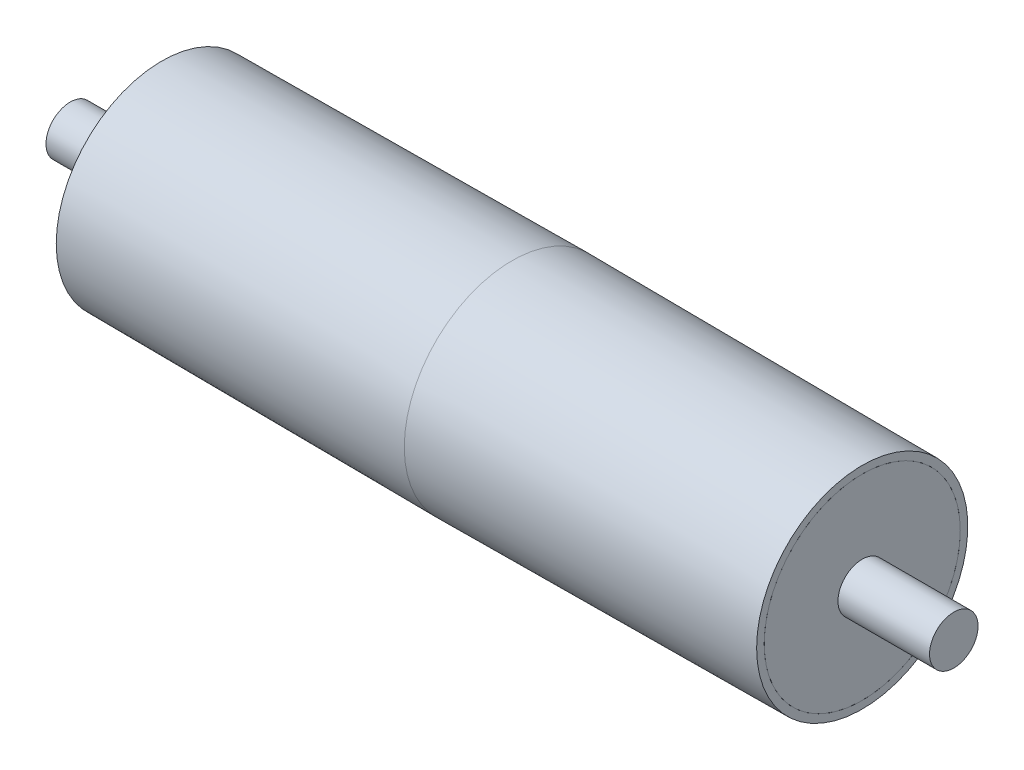
ISO-10303-21;
HEADER;
FILE_DESCRIPTION(('STEP AP214'),'2;1');
FILE_NAME('part.step','',(''),(''),'','','');
FILE_SCHEMA(('AUTOMOTIVE_DESIGN { 1 0 10303 214 1 1 1 1 }'));
ENDSEC;
DATA;
#1=APPLICATION_CONTEXT('core data for automotive mechanical design processes');
#2=APPLICATION_PROTOCOL_DEFINITION('international standard','automotive_design',2000,#1);
#3=PRODUCT_CONTEXT('',#1,'mechanical');
#4=PRODUCT('Part','Part','',(#3));
#5=PRODUCT_RELATED_PRODUCT_CATEGORY('part','',(#4));
#6=PRODUCT_DEFINITION_FORMATION('','',#4);
#7=PRODUCT_DEFINITION_CONTEXT('part definition',#1,'design');
#8=PRODUCT_DEFINITION('design','',#6,#7);
#9=PRODUCT_DEFINITION_SHAPE('','',#8);
#10=(LENGTH_UNIT() NAMED_UNIT(*) SI_UNIT(.MILLI.,.METRE.));
#11=(NAMED_UNIT(*) PLANE_ANGLE_UNIT() SI_UNIT($,.RADIAN.));
#12=(NAMED_UNIT(*) SI_UNIT($,.STERADIAN.) SOLID_ANGLE_UNIT());
#13=UNCERTAINTY_MEASURE_WITH_UNIT(LENGTH_MEASURE(1.E-05),#10,'distance_accuracy_value','');
#14=(GEOMETRIC_REPRESENTATION_CONTEXT(3) GLOBAL_UNCERTAINTY_ASSIGNED_CONTEXT((#13)) GLOBAL_UNIT_ASSIGNED_CONTEXT((#10,
#11,#12)) REPRESENTATION_CONTEXT('',''));
#15=CARTESIAN_POINT('',(0.,0.,0.));
#16=DIRECTION('',(0.,0.,1.));
#17=DIRECTION('',(1.,0.,0.));
#18=AXIS2_PLACEMENT_3D('',#15,#16,#17);
#19=CARTESIAN_POINT('',(410.,0.,0.));
#20=DIRECTION('',(-1.,0.,0.));
#21=DIRECTION('',(0.,0.,1.));
#22=AXIS2_PLACEMENT_3D('',#19,#20,#21);
#23=CYLINDRICAL_SURFACE('',#22,22.5);
#24=CARTESIAN_POINT('',(410.,0.,0.));
#25=DIRECTION('',(1.,0.,0.));
#26=DIRECTION('',(0.,0.,-1.));
#27=AXIS2_PLACEMENT_3D('',#24,#25,#26);
#28=CIRCLE('',#27,22.5);
#29=CARTESIAN_POINT('',(410.,0.,22.5));
#30=VERTEX_POINT('',#29);
#31=EDGE_CURVE('E11',#30,#30,#28,.T.);
#32=CARTESIAN_POINT('',(-410.,0.,0.));
#33=DIRECTION('',(1.,0.,0.));
#34=DIRECTION('',(0.,0.,-1.));
#35=AXIS2_PLACEMENT_3D('',#32,#33,#34);
#36=CIRCLE('',#35,22.5);
#37=CARTESIAN_POINT('',(-410.,0.,22.5));
#38=VERTEX_POINT('',#37);
#39=EDGE_CURVE('E42',#38,#38,#36,.T.);
#40=CARTESIAN_POINT('',(410.,0.,22.5));
#41=CARTESIAN_POINT('',(401.458333333333,0.,22.5));
#42=CARTESIAN_POINT('',(392.916666666667,0.,22.5));
#43=CARTESIAN_POINT('',(375.833333333333,0.,22.5));
#44=CARTESIAN_POINT('',(367.291666666667,0.,22.5));
#45=CARTESIAN_POINT('',(350.208333333333,0.,22.5));
#46=CARTESIAN_POINT('',(341.666666666667,0.,22.5));
#47=CARTESIAN_POINT('',(324.583333333333,0.,22.5));
#48=CARTESIAN_POINT('',(316.041666666667,0.,22.5));
#49=CARTESIAN_POINT('',(298.958333333333,0.,22.5));
#50=CARTESIAN_POINT('',(290.416666666667,0.,22.5));
#51=CARTESIAN_POINT('',(273.333333333333,0.,22.5));
#52=CARTESIAN_POINT('',(264.791666666667,0.,22.5));
#53=CARTESIAN_POINT('',(247.708333333333,0.,22.5));
#54=CARTESIAN_POINT('',(239.166666666667,0.,22.5));
#55=CARTESIAN_POINT('',(222.083333333333,0.,22.5));
#56=CARTESIAN_POINT('',(213.541666666667,0.,22.5));
#57=CARTESIAN_POINT('',(196.458333333333,0.,22.5));
#58=CARTESIAN_POINT('',(187.916666666667,0.,22.5));
#59=CARTESIAN_POINT('',(170.833333333333,0.,22.5));
#60=CARTESIAN_POINT('',(162.291666666667,0.,22.5));
#61=CARTESIAN_POINT('',(145.208333333333,0.,22.5));
#62=CARTESIAN_POINT('',(136.666666666667,0.,22.5));
#63=CARTESIAN_POINT('',(119.583333333333,0.,22.5));
#64=CARTESIAN_POINT('',(111.041666666667,0.,22.5));
#65=CARTESIAN_POINT('',(93.9583333333333,0.,22.5));
#66=CARTESIAN_POINT('',(85.4166666666666,0.,22.5));
#67=CARTESIAN_POINT('',(68.3333333333333,0.,22.5));
#68=CARTESIAN_POINT('',(59.7916666666666,0.,22.5));
#69=CARTESIAN_POINT('',(42.7083333333333,0.,22.5));
#70=CARTESIAN_POINT('',(34.1666666666666,0.,22.5));
#71=CARTESIAN_POINT('',(17.0833333333333,0.,22.5));
#72=CARTESIAN_POINT('',(8.54166666666661,0.,22.5));
#73=CARTESIAN_POINT('',(-8.54166666666672,0.,22.5));
#74=CARTESIAN_POINT('',(-17.0833333333334,0.,22.5));
#75=CARTESIAN_POINT('',(-34.1666666666667,0.,22.5));
#76=CARTESIAN_POINT('',(-42.7083333333334,0.,22.5));
#77=CARTESIAN_POINT('',(-59.7916666666667,0.,22.5));
#78=CARTESIAN_POINT('',(-68.3333333333334,0.,22.5));
#79=CARTESIAN_POINT('',(-85.4166666666667,0.,22.5));
#80=CARTESIAN_POINT('',(-93.9583333333334,0.,22.5));
#81=CARTESIAN_POINT('',(-111.041666666667,0.,22.5));
#82=CARTESIAN_POINT('',(-119.583333333333,0.,22.5));
#83=CARTESIAN_POINT('',(-136.666666666667,0.,22.5));
#84=CARTESIAN_POINT('',(-145.208333333333,0.,22.5));
#85=CARTESIAN_POINT('',(-162.291666666667,0.,22.5));
#86=CARTESIAN_POINT('',(-170.833333333333,0.,22.5));
#87=CARTESIAN_POINT('',(-187.916666666667,0.,22.5));
#88=CARTESIAN_POINT('',(-196.458333333333,0.,22.5));
#89=CARTESIAN_POINT('',(-213.541666666667,0.,22.5));
#90=CARTESIAN_POINT('',(-222.083333333333,0.,22.5));
#91=CARTESIAN_POINT('',(-239.166666666667,0.,22.5));
#92=CARTESIAN_POINT('',(-247.708333333333,0.,22.5));
#93=CARTESIAN_POINT('',(-264.791666666667,0.,22.5));
#94=CARTESIAN_POINT('',(-273.333333333333,0.,22.5));
#95=CARTESIAN_POINT('',(-290.416666666667,0.,22.5));
#96=CARTESIAN_POINT('',(-298.958333333333,0.,22.5));
#97=CARTESIAN_POINT('',(-316.041666666667,0.,22.5));
#98=CARTESIAN_POINT('',(-324.583333333333,0.,22.5));
#99=CARTESIAN_POINT('',(-341.666666666667,0.,22.5));
#100=CARTESIAN_POINT('',(-350.208333333333,0.,22.5));
#101=CARTESIAN_POINT('',(-367.291666666667,0.,22.5));
#102=CARTESIAN_POINT('',(-375.833333333333,0.,22.5));
#103=CARTESIAN_POINT('',(-392.916666666667,0.,22.5));
#104=CARTESIAN_POINT('',(-401.458333333333,0.,22.5));
#105=CARTESIAN_POINT('',(-410.,0.,22.5));
#106=B_SPLINE_CURVE_WITH_KNOTS('',3,(#40,#41,#42,#43,#44,#45,#46,#47,#48,#49,#50,#51,#52,#53,
#54,#55,#56,#57,#58,#59,#60,#61,#62,#63,#64,#65,#66,#67,#68,#69,#70,#71,#72,#73,#74,#75,#76,#77,
#78,#79,#80,#81,#82,#83,#84,#85,#86,#87,#88,#89,#90,#91,#92,#93,#94,#95,#96,#97,#98,#99,#100,
#101,#102,#103,#104,#105),.UNSPECIFIED.,.F.,.F.,(4,2,2,2,2,2,2,2,2,2,2,2,2,2,2,2,2,2,2,2,2,2,2,
2,2,2,2,2,2,2,2,2,4),(0.,25.625,51.25,76.875,102.5,128.125,153.75,179.375,205.,230.625,256.25,
281.875,307.5,333.125,358.75,384.375,410.,435.625,461.25,486.875,512.5,538.125,563.75,589.375,
615.,640.625,666.25,691.875,717.5,743.125,768.75,794.375,820.),.UNSPECIFIED.);
#107=EDGE_CURVE('BSEAM39',#30,#38,#106,.T.);
#108=ORIENTED_EDGE('',*,*,#31,.F.);
#109=ORIENTED_EDGE('',*,*,#39,.T.);
#110=ORIENTED_EDGE('',*,*,#107,.T.);
#111=ORIENTED_EDGE('',*,*,#107,.F.);
#112=EDGE_LOOP('',(#108,#110,#109,#111));
#113=FACE_BOUND('',#112,.T.);
#114=ADVANCED_FACE('F39',(#113),#23,.T.);
#115=CARTESIAN_POINT('',(410.,0.,0.));
#116=DIRECTION('',(1.,0.,0.));
#117=DIRECTION('',(0.,0.,-1.));
#118=AXIS2_PLACEMENT_3D('',#115,#116,#117);
#119=PLANE('',#118);
#120=ORIENTED_EDGE('',*,*,#31,.T.);
#121=EDGE_LOOP('',(#120));
#122=FACE_BOUND('',#121,.T.);
#123=ADVANCED_FACE('F54',(#122),#119,.T.);
#124=CARTESIAN_POINT('',(-410.,0.,0.));
#125=DIRECTION('',(1.,0.,0.));
#126=DIRECTION('',(0.,0.,-1.));
#127=AXIS2_PLACEMENT_3D('',#124,#125,#126);
#128=PLANE('',#127);
#129=ORIENTED_EDGE('',*,*,#39,.F.);
#130=EDGE_LOOP('',(#129));
#131=FACE_BOUND('',#130,.T.);
#132=ADVANCED_FACE('F52',(#131),#128,.F.);
#133=CLOSED_SHELL('',(#114,#123,#132));
#134=MANIFOLD_SOLID_BREP('B2',#133);
#135=CARTESIAN_POINT('',(-315.,0.,0.));
#136=DIRECTION('',(-1.,0.,0.));
#137=DIRECTION('',(0.,0.,-1.));
#138=AXIS2_PLACEMENT_3D('',#135,#136,#137);
#139=CYLINDRICAL_SURFACE('',#138,90.9998674568761);
#140=CARTESIAN_POINT('',(-315.,0.,0.));
#141=DIRECTION('',(1.,0.,0.));
#142=DIRECTION('',(0.,0.,-1.));
#143=AXIS2_PLACEMENT_3D('',#140,#141,#142);
#144=CIRCLE('',#143,90.9998674568761);
#145=CARTESIAN_POINT('',(-315.,0.,-90.9998674568761));
#146=VERTEX_POINT('',#145);
#147=EDGE_CURVE('E38',#146,#146,#144,.T.);
#148=ORIENTED_EDGE('',*,*,#147,.F.);
#149=EDGE_LOOP('',(#148));
#150=FACE_BOUND('',#149,.T.);
#151=CARTESIAN_POINT('',(-325.,0.,0.));
#152=DIRECTION('',(1.,0.,0.));
#153=DIRECTION('',(0.,0.,-1.));
#154=AXIS2_PLACEMENT_3D('',#151,#152,#153);
#155=CIRCLE('',#154,90.9998674568761);
#156=CARTESIAN_POINT('',(-325.,0.,-90.9998674568761));
#157=VERTEX_POINT('',#156);
#158=EDGE_CURVE('E94',#157,#157,#155,.T.);
#159=ORIENTED_EDGE('',*,*,#158,.T.);
#160=EDGE_LOOP('',(#159));
#161=FACE_BOUND('',#160,.T.);
#162=ADVANCED_FACE('F87',(#150,#161),#139,.T.);
#163=CARTESIAN_POINT('',(-315.,0.,0.));
#164=DIRECTION('',(-1.,0.,0.));
#165=DIRECTION('',(0.,0.,-1.));
#166=AXIS2_PLACEMENT_3D('',#163,#164,#165);
#167=PLANE('',#166);
#168=CARTESIAN_POINT('',(-315.,0.,0.));
#169=DIRECTION('',(-1.,0.,0.));
#170=DIRECTION('',(0.,0.,1.));
#171=AXIS2_PLACEMENT_3D('',#168,#169,#170);
#172=CIRCLE('',#171,22.5);
#173=CARTESIAN_POINT('',(-315.,0.,22.5));
#174=VERTEX_POINT('',#173);
#175=EDGE_CURVE('E99',#174,#174,#172,.T.);
#176=ORIENTED_EDGE('',*,*,#175,.T.);
#177=EDGE_LOOP('',(#176));
#178=FACE_BOUND('',#177,.T.);
#179=ORIENTED_EDGE('',*,*,#147,.T.);
#180=EDGE_LOOP('',(#179));
#181=FACE_BOUND('',#180,.T.);
#182=ADVANCED_FACE('F113',(#178,#181),#167,.F.);
#183=CARTESIAN_POINT('',(-325.,0.,0.));
#184=DIRECTION('',(-1.,0.,0.));
#185=DIRECTION('',(0.,0.,-1.));
#186=AXIS2_PLACEMENT_3D('',#183,#184,#185);
#187=PLANE('',#186);
#188=CARTESIAN_POINT('',(-325.,0.,0.));
#189=DIRECTION('',(-1.,0.,0.));
#190=DIRECTION('',(0.,0.,1.));
#191=AXIS2_PLACEMENT_3D('',#188,#189,#190);
#192=CIRCLE('',#191,22.5);
#193=CARTESIAN_POINT('',(-325.,0.,22.5));
#194=VERTEX_POINT('',#193);
#195=EDGE_CURVE('E90',#194,#194,#192,.T.);
#196=ORIENTED_EDGE('',*,*,#195,.F.);
#197=EDGE_LOOP('',(#196));
#198=FACE_BOUND('',#197,.T.);
#199=ORIENTED_EDGE('',*,*,#158,.F.);
#200=EDGE_LOOP('',(#199));
#201=FACE_BOUND('',#200,.T.);
#202=ADVANCED_FACE('F110',(#198,#201),#187,.T.);
#203=CARTESIAN_POINT('',(-410.,0.,0.));
#204=DIRECTION('',(1.,0.,0.));
#205=DIRECTION('',(0.,0.,-1.));
#206=AXIS2_PLACEMENT_3D('',#203,#204,#205);
#207=CYLINDRICAL_SURFACE('',#206,22.5);
#208=ORIENTED_EDGE('',*,*,#195,.T.);
#209=EDGE_LOOP('',(#208));
#210=FACE_BOUND('',#209,.T.);
#211=ORIENTED_EDGE('',*,*,#175,.F.);
#212=EDGE_LOOP('',(#211));
#213=FACE_BOUND('',#212,.T.);
#214=ADVANCED_FACE('F107',(#210,#213),#207,.F.);
#215=CLOSED_SHELL('',(#162,#182,#202,#214));
#216=MANIFOLD_SOLID_BREP('B6',#215);
#217=CARTESIAN_POINT('',(315.,0.,0.));
#218=DIRECTION('',(1.,0.,0.));
#219=DIRECTION('',(0.,0.,-1.));
#220=AXIS2_PLACEMENT_3D('',#217,#218,#219);
#221=CYLINDRICAL_SURFACE('',#220,90.9998674568761);
#222=CARTESIAN_POINT('',(315.,0.,0.));
#223=DIRECTION('',(1.,0.,0.));
#224=DIRECTION('',(0.,0.,-1.));
#225=AXIS2_PLACEMENT_3D('',#222,#223,#224);
#226=CIRCLE('',#225,90.9998674568761);
#227=CARTESIAN_POINT('',(315.,0.,-90.9998674568761));
#228=VERTEX_POINT('',#227);
#229=EDGE_CURVE('E86',#228,#228,#226,.T.);
#230=ORIENTED_EDGE('',*,*,#229,.T.);
#231=EDGE_LOOP('',(#230));
#232=FACE_BOUND('',#231,.T.);
#233=CARTESIAN_POINT('',(325.,0.,0.));
#234=DIRECTION('',(1.,0.,0.));
#235=DIRECTION('',(0.,0.,-1.));
#236=AXIS2_PLACEMENT_3D('',#233,#234,#235);
#237=CIRCLE('',#236,90.9998674568761);
#238=CARTESIAN_POINT('',(325.,0.,-90.9998674568761));
#239=VERTEX_POINT('',#238);
#240=EDGE_CURVE('E158',#239,#239,#237,.T.);
#241=ORIENTED_EDGE('',*,*,#240,.F.);
#242=EDGE_LOOP('',(#241));
#243=FACE_BOUND('',#242,.T.);
#244=ADVANCED_FACE('F155',(#232,#243),#221,.T.);
#245=CARTESIAN_POINT('',(315.,0.,0.));
#246=DIRECTION('',(1.,0.,0.));
#247=DIRECTION('',(0.,0.,-1.));
#248=AXIS2_PLACEMENT_3D('',#245,#246,#247);
#249=PLANE('',#248);
#250=CARTESIAN_POINT('',(315.,0.,0.));
#251=DIRECTION('',(1.,0.,0.));
#252=DIRECTION('',(0.,0.,-1.));
#253=AXIS2_PLACEMENT_3D('',#250,#251,#252);
#254=CIRCLE('',#253,22.5);
#255=CARTESIAN_POINT('',(315.,0.,-22.5));
#256=VERTEX_POINT('',#255);
#257=EDGE_CURVE('E165',#256,#256,#254,.T.);
#258=ORIENTED_EDGE('',*,*,#257,.T.);
#259=EDGE_LOOP('',(#258));
#260=FACE_BOUND('',#259,.T.);
#261=ORIENTED_EDGE('',*,*,#229,.F.);
#262=EDGE_LOOP('',(#261));
#263=FACE_BOUND('',#262,.T.);
#264=ADVANCED_FACE('F179',(#260,#263),#249,.F.);
#265=CARTESIAN_POINT('',(325.,0.,0.));
#266=DIRECTION('',(1.,0.,0.));
#267=DIRECTION('',(0.,0.,-1.));
#268=AXIS2_PLACEMENT_3D('',#265,#266,#267);
#269=PLANE('',#268);
#270=CARTESIAN_POINT('',(325.,0.,0.));
#271=DIRECTION('',(1.,0.,0.));
#272=DIRECTION('',(0.,0.,-1.));
#273=AXIS2_PLACEMENT_3D('',#270,#271,#272);
#274=CIRCLE('',#273,22.5);
#275=CARTESIAN_POINT('',(325.,0.,-22.5));
#276=VERTEX_POINT('',#275);
#277=EDGE_CURVE('E169',#276,#276,#274,.T.);
#278=ORIENTED_EDGE('',*,*,#277,.F.);
#279=EDGE_LOOP('',(#278));
#280=FACE_BOUND('',#279,.T.);
#281=ORIENTED_EDGE('',*,*,#240,.T.);
#282=EDGE_LOOP('',(#281));
#283=FACE_BOUND('',#282,.T.);
#284=ADVANCED_FACE('F176',(#280,#283),#269,.T.);
#285=CARTESIAN_POINT('',(-410.,0.,0.));
#286=DIRECTION('',(1.,0.,0.));
#287=DIRECTION('',(0.,0.,-1.));
#288=AXIS2_PLACEMENT_3D('',#285,#286,#287);
#289=CYLINDRICAL_SURFACE('',#288,22.5);
#290=ORIENTED_EDGE('',*,*,#277,.T.);
#291=EDGE_LOOP('',(#290));
#292=FACE_BOUND('',#291,.T.);
#293=ORIENTED_EDGE('',*,*,#257,.F.);
#294=EDGE_LOOP('',(#293));
#295=FACE_BOUND('',#294,.T.);
#296=ADVANCED_FACE('F173',(#292,#295),#289,.F.);
#297=CLOSED_SHELL('',(#244,#264,#284,#296));
#298=MANIFOLD_SOLID_BREP('B33',#297);
#299=CARTESIAN_POINT('',(-325.,98.,0.));
#300=DIRECTION('',(1.,0.,0.));
#301=DIRECTION('',(0.,0.,-1.));
#302=AXIS2_PLACEMENT_3D('',#299,#300,#301);
#303=PLANE('',#302);
#304=CARTESIAN_POINT('',(-325.,0.,0.));
#305=DIRECTION('',(1.,0.,0.));
#306=DIRECTION('',(0.,0.,-1.));
#307=AXIS2_PLACEMENT_3D('',#304,#305,#306);
#308=CIRCLE('',#307,90.9998674568761);
#309=CARTESIAN_POINT('',(-325.,0.,-90.9998674568761));
#310=VERTEX_POINT('',#309);
#311=EDGE_CURVE('E233',#310,#310,#308,.F.);
#312=ORIENTED_EDGE('',*,*,#311,.F.);
#313=EDGE_LOOP('',(#312));
#314=FACE_BOUND('',#313,.T.);
#315=CARTESIAN_POINT('',(-325.,0.,0.));
#316=DIRECTION('',(-1.,0.,0.));
#317=DIRECTION('',(0.,0.,1.));
#318=AXIS2_PLACEMENT_3D('',#315,#316,#317);
#319=CIRCLE('',#318,98.);
#320=CARTESIAN_POINT('',(-325.,0.,98.));
#321=VERTEX_POINT('',#320);
#322=EDGE_CURVE('E226',#321,#321,#319,.T.);
#323=ORIENTED_EDGE('',*,*,#322,.T.);
#324=EDGE_LOOP('',(#323));
#325=FACE_BOUND('',#324,.T.);
#326=ADVANCED_FACE('F216',(#314,#325),#303,.F.);
#327=CARTESIAN_POINT('',(325.,0.,0.));
#328=DIRECTION('',(-1.,0.,0.));
#329=DIRECTION('',(0.,0.,1.));
#330=AXIS2_PLACEMENT_3D('',#327,#328,#329);
#331=PLANE('',#330);
#332=CARTESIAN_POINT('',(325.,0.,0.));
#333=DIRECTION('',(-1.,0.,0.));
#334=DIRECTION('',(0.,0.,1.));
#335=AXIS2_PLACEMENT_3D('',#332,#333,#334);
#336=CIRCLE('',#335,90.9998674568761);
#337=CARTESIAN_POINT('',(325.,0.,90.9998674568761));
#338=VERTEX_POINT('',#337);
#339=EDGE_CURVE('E230',#338,#338,#336,.T.);
#340=ORIENTED_EDGE('',*,*,#339,.T.);
#341=EDGE_LOOP('',(#340));
#342=FACE_BOUND('',#341,.T.);
#343=CARTESIAN_POINT('',(325.,0.,0.));
#344=DIRECTION('',(-1.,0.,0.));
#345=DIRECTION('',(0.,0.,1.));
#346=AXIS2_PLACEMENT_3D('',#343,#344,#345);
#347=CIRCLE('',#346,98.);
#348=CARTESIAN_POINT('',(325.,0.,98.));
#349=VERTEX_POINT('',#348);
#350=EDGE_CURVE('E154',#349,#349,#347,.T.);
#351=ORIENTED_EDGE('',*,*,#350,.F.);
#352=EDGE_LOOP('',(#351));
#353=FACE_BOUND('',#352,.T.);
#354=ADVANCED_FACE('F256',(#342,#353),#331,.F.);
#355=CARTESIAN_POINT('',(325.,0.,0.));
#356=DIRECTION('',(-1.,0.,0.));
#357=DIRECTION('',(0.,0.,1.));
#358=AXIS2_PLACEMENT_3D('',#355,#356,#357);
#359=CONICAL_SURFACE('',#358,98.,0.00615376847392404);
#360=CARTESIAN_POINT('',(0.,0.,0.));
#361=DIRECTION('',(-1.,0.,0.));
#362=DIRECTION('',(0.,0.,1.));
#363=AXIS2_PLACEMENT_3D('',#360,#361,#362);
#364=CIRCLE('',#363,100.);
#365=CARTESIAN_POINT('',(0.,0.,100.));
#366=VERTEX_POINT('',#365);
#367=EDGE_CURVE('E222',#366,#366,#364,.T.);
#368=ORIENTED_EDGE('',*,*,#367,.F.);
#369=EDGE_LOOP('',(#368));
#370=FACE_BOUND('',#369,.T.);
#371=ORIENTED_EDGE('',*,*,#350,.T.);
#372=EDGE_LOOP('',(#371));
#373=FACE_BOUND('',#372,.T.);
#374=ADVANCED_FACE('F261',(#370,#373),#359,.T.);
#375=CARTESIAN_POINT('',(0.,0.,0.));
#376=DIRECTION('',(1.,0.,0.));
#377=DIRECTION('',(0.,0.,-1.));
#378=AXIS2_PLACEMENT_3D('',#375,#376,#377);
#379=CONICAL_SURFACE('',#378,100.,0.00615376847392404);
#380=ORIENTED_EDGE('',*,*,#322,.F.);
#381=EDGE_LOOP('',(#380));
#382=FACE_BOUND('',#381,.T.);
#383=ORIENTED_EDGE('',*,*,#367,.T.);
#384=EDGE_LOOP('',(#383));
#385=FACE_BOUND('',#384,.T.);
#386=ADVANCED_FACE('F252',(#382,#385),#379,.T.);
#387=CARTESIAN_POINT('',(324.956923892558,0.,0.));
#388=DIRECTION('',(-1.,0.,0.));
#389=DIRECTION('',(0.,0.,1.));
#390=AXIS2_PLACEMENT_3D('',#387,#388,#389);
#391=CONICAL_SURFACE('',#390,91.0001325406142,0.00615376847392404);
#392=CARTESIAN_POINT('',(-3.5527136788005E-12,0.,0.));
#393=DIRECTION('',(-1.,0.,0.));
#394=DIRECTION('',(0.,0.,1.));
#395=AXIS2_PLACEMENT_3D('',#392,#393,#394);
#396=CIRCLE('',#395,92.9998674568761);
#397=CARTESIAN_POINT('',(-3.5527136788005E-12,0.,92.9998674568761));
#398=VERTEX_POINT('',#397);
#399=EDGE_CURVE('E236',#398,#398,#396,.T.);
#400=ORIENTED_EDGE('',*,*,#399,.T.);
#401=EDGE_LOOP('',(#400));
#402=FACE_BOUND('',#401,.T.);
#403=ORIENTED_EDGE('',*,*,#339,.F.);
#404=EDGE_LOOP('',(#403));
#405=FACE_BOUND('',#404,.T.);
#406=ADVANCED_FACE('F242',(#402,#405),#391,.F.);
#407=CARTESIAN_POINT('',(0.0430761074423739,0.,0.));
#408=DIRECTION('',(1.,0.,0.));
#409=DIRECTION('',(0.,0.,-1.));
#410=AXIS2_PLACEMENT_3D('',#407,#408,#409);
#411=CONICAL_SURFACE('',#410,93.0001325406142,0.00615376847392404);
#412=ORIENTED_EDGE('',*,*,#311,.T.);
#413=EDGE_LOOP('',(#412));
#414=FACE_BOUND('',#413,.T.);
#415=ORIENTED_EDGE('',*,*,#399,.F.);
#416=EDGE_LOOP('',(#415));
#417=FACE_BOUND('',#416,.T.);
#418=ADVANCED_FACE('F245',(#414,#417),#411,.F.);
#419=CLOSED_SHELL('',(#326,#354,#374,#386,#406,#418));
#420=MANIFOLD_SOLID_BREP('B81',#419);
#421=ADVANCED_BREP_SHAPE_REPRESENTATION('',(#18,#134,#216,#298,#420),#14);
#422=SHAPE_DEFINITION_REPRESENTATION(#9,#421);
ENDSEC;
END-ISO-10303-21;
